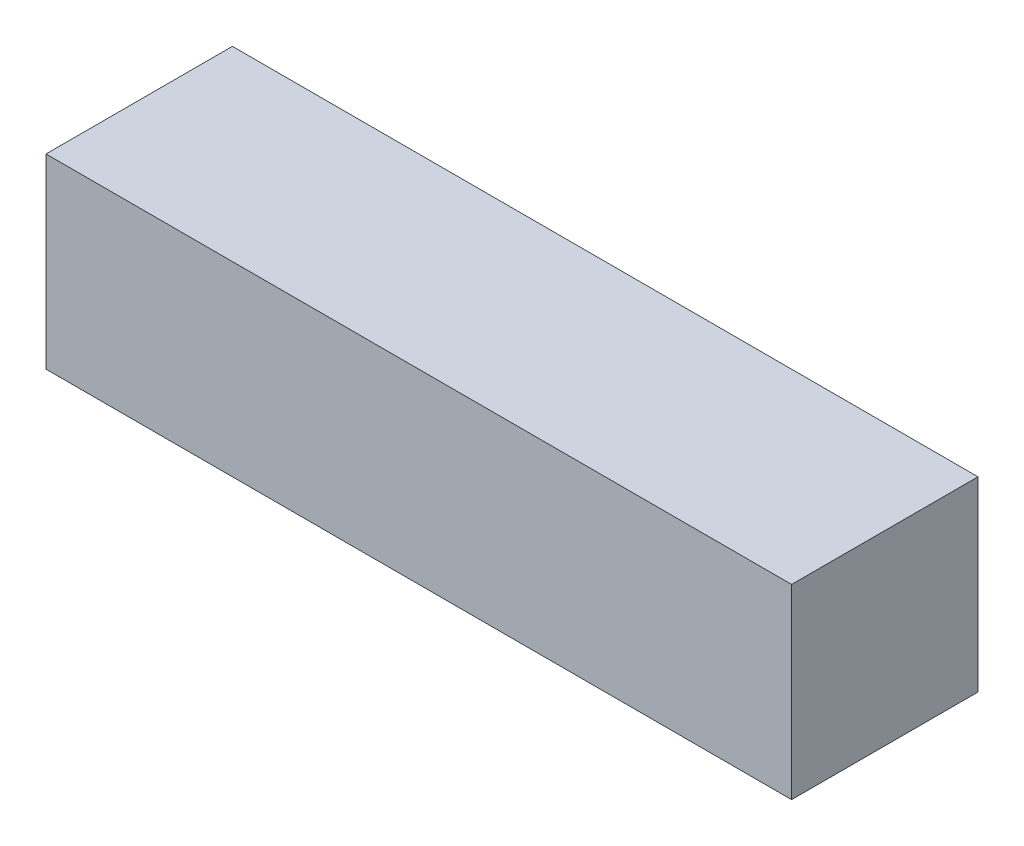
ISO-10303-21;
HEADER;
FILE_DESCRIPTION(('STEP AP214'),'2;1');
FILE_NAME('part.step','',(''),(''),'','','');
FILE_SCHEMA(('AUTOMOTIVE_DESIGN { 1 0 10303 214 1 1 1 1 }'));
ENDSEC;
DATA;
#1=APPLICATION_CONTEXT('core data for automotive mechanical design processes');
#2=APPLICATION_PROTOCOL_DEFINITION('international standard','automotive_design',2000,#1);
#3=PRODUCT_CONTEXT('',#1,'mechanical');
#4=PRODUCT('Part','Part','',(#3));
#5=PRODUCT_RELATED_PRODUCT_CATEGORY('part','',(#4));
#6=PRODUCT_DEFINITION_FORMATION('','',#4);
#7=PRODUCT_DEFINITION_CONTEXT('part definition',#1,'design');
#8=PRODUCT_DEFINITION('design','',#6,#7);
#9=PRODUCT_DEFINITION_SHAPE('','',#8);
#10=(LENGTH_UNIT() NAMED_UNIT(*) SI_UNIT(.MILLI.,.METRE.));
#11=(NAMED_UNIT(*) PLANE_ANGLE_UNIT() SI_UNIT($,.RADIAN.));
#12=(NAMED_UNIT(*) SI_UNIT($,.STERADIAN.) SOLID_ANGLE_UNIT());
#13=UNCERTAINTY_MEASURE_WITH_UNIT(LENGTH_MEASURE(1.E-05),#10,'distance_accuracy_value','');
#14=(GEOMETRIC_REPRESENTATION_CONTEXT(3) GLOBAL_UNCERTAINTY_ASSIGNED_CONTEXT((#13)) GLOBAL_UNIT_ASSIGNED_CONTEXT((#10,
#11,#12)) REPRESENTATION_CONTEXT('',''));
#15=CARTESIAN_POINT('',(0.,0.,0.));
#16=DIRECTION('',(0.,0.,1.));
#17=DIRECTION('',(1.,0.,0.));
#18=AXIS2_PLACEMENT_3D('',#15,#16,#17);
#19=CARTESIAN_POINT('',(-6.35,-1.5875,-1.5875));
#20=DIRECTION('',(-1.,0.,0.));
#21=DIRECTION('',(0.,0.,1.));
#22=AXIS2_PLACEMENT_3D('',#19,#20,#21);
#23=PLANE('',#22);
#24=DIRECTION('',(0.,1.,0.));
#25=VECTOR('',#24,1.);
#26=CARTESIAN_POINT('',(-6.35,-1.5875,1.5875));
#27=LINE('',#26,#25);
#28=CARTESIAN_POINT('',(-6.35,-1.5875,1.5875));
#29=VERTEX_POINT('',#28);
#30=CARTESIAN_POINT('',(-6.35,1.5875,1.5875));
#31=VERTEX_POINT('',#30);
#32=EDGE_CURVE('E37',#29,#31,#27,.T.);
#33=ORIENTED_EDGE('',*,*,#32,.T.);
#34=DIRECTION('',(0.,0.,1.));
#35=VECTOR('',#34,1.);
#36=CARTESIAN_POINT('',(-6.35,1.5875,-1.5875));
#37=LINE('',#36,#35);
#38=CARTESIAN_POINT('',(-6.35,1.5875,-1.5875));
#39=VERTEX_POINT('',#38);
#40=EDGE_CURVE('E74',#39,#31,#37,.T.);
#41=ORIENTED_EDGE('',*,*,#40,.F.);
#42=DIRECTION('',(0.,1.,0.));
#43=VECTOR('',#42,1.);
#44=CARTESIAN_POINT('',(-6.35,-1.5875,-1.5875));
#45=LINE('',#44,#43);
#46=CARTESIAN_POINT('',(-6.35,-1.5875,-1.5875));
#47=VERTEX_POINT('',#46);
#48=EDGE_CURVE('E11',#47,#39,#45,.T.);
#49=ORIENTED_EDGE('',*,*,#48,.F.);
#50=DIRECTION('',(0.,0.,1.));
#51=VECTOR('',#50,1.);
#52=CARTESIAN_POINT('',(-6.35,-1.5875,-1.5875));
#53=LINE('',#52,#51);
#54=EDGE_CURVE('E75',#47,#29,#53,.T.);
#55=ORIENTED_EDGE('',*,*,#54,.T.);
#56=EDGE_LOOP('',(#33,#41,#49,#55));
#57=FACE_BOUND('',#56,.T.);
#58=ADVANCED_FACE('F34',(#57),#23,.T.);
#59=CARTESIAN_POINT('',(-6.35,-1.5875,-1.5875));
#60=DIRECTION('',(0.,0.,-1.));
#61=DIRECTION('',(-1.,0.,0.));
#62=AXIS2_PLACEMENT_3D('',#59,#60,#61);
#63=PLANE('',#62);
#64=ORIENTED_EDGE('',*,*,#48,.T.);
#65=DIRECTION('',(-1.,0.,0.));
#66=VECTOR('',#65,1.);
#67=CARTESIAN_POINT('',(-6.35,1.5875,-1.5875));
#68=LINE('',#67,#66);
#69=CARTESIAN_POINT('',(6.35,1.5875,-1.5875));
#70=VERTEX_POINT('',#69);
#71=EDGE_CURVE('E91',#70,#39,#68,.T.);
#72=ORIENTED_EDGE('',*,*,#71,.F.);
#73=DIRECTION('',(0.,1.,0.));
#74=VECTOR('',#73,1.);
#75=CARTESIAN_POINT('',(6.35,-1.5875,-1.5875));
#76=LINE('',#75,#74);
#77=CARTESIAN_POINT('',(6.35,-1.5875,-1.5875));
#78=VERTEX_POINT('',#77);
#79=EDGE_CURVE('E42',#78,#70,#76,.T.);
#80=ORIENTED_EDGE('',*,*,#79,.F.);
#81=DIRECTION('',(-1.,0.,0.));
#82=VECTOR('',#81,1.);
#83=CARTESIAN_POINT('',(-6.35,-1.5875,-1.5875));
#84=LINE('',#83,#82);
#85=EDGE_CURVE('E80',#78,#47,#84,.T.);
#86=ORIENTED_EDGE('',*,*,#85,.T.);
#87=EDGE_LOOP('',(#64,#72,#80,#86));
#88=FACE_BOUND('',#87,.T.);
#89=ADVANCED_FACE('F106',(#88),#63,.T.);
#90=CARTESIAN_POINT('',(6.35,-1.5875,-1.5875));
#91=DIRECTION('',(1.,0.,0.));
#92=DIRECTION('',(0.,0.,-1.));
#93=AXIS2_PLACEMENT_3D('',#90,#91,#92);
#94=PLANE('',#93);
#95=ORIENTED_EDGE('',*,*,#79,.T.);
#96=DIRECTION('',(0.,0.,-1.));
#97=VECTOR('',#96,1.);
#98=CARTESIAN_POINT('',(6.35,1.5875,-1.5875));
#99=LINE('',#98,#97);
#100=CARTESIAN_POINT('',(6.35,1.5875,1.5875));
#101=VERTEX_POINT('',#100);
#102=EDGE_CURVE('E87',#101,#70,#99,.T.);
#103=ORIENTED_EDGE('',*,*,#102,.F.);
#104=DIRECTION('',(0.,1.,0.));
#105=VECTOR('',#104,1.);
#106=CARTESIAN_POINT('',(6.35,-1.5875,1.5875));
#107=LINE('',#106,#105);
#108=CARTESIAN_POINT('',(6.35,-1.5875,1.5875));
#109=VERTEX_POINT('',#108);
#110=EDGE_CURVE('E79',#109,#101,#107,.T.);
#111=ORIENTED_EDGE('',*,*,#110,.F.);
#112=DIRECTION('',(0.,0.,-1.));
#113=VECTOR('',#112,1.);
#114=CARTESIAN_POINT('',(6.35,-1.5875,-1.5875));
#115=LINE('',#114,#113);
#116=EDGE_CURVE('E99',#109,#78,#115,.T.);
#117=ORIENTED_EDGE('',*,*,#116,.T.);
#118=EDGE_LOOP('',(#95,#103,#111,#117));
#119=FACE_BOUND('',#118,.T.);
#120=ADVANCED_FACE('F103',(#119),#94,.T.);
#121=CARTESIAN_POINT('',(-6.35,-1.5875,1.5875));
#122=DIRECTION('',(0.,0.,1.));
#123=DIRECTION('',(1.,0.,0.));
#124=AXIS2_PLACEMENT_3D('',#121,#122,#123);
#125=PLANE('',#124);
#126=ORIENTED_EDGE('',*,*,#110,.T.);
#127=DIRECTION('',(1.,0.,0.));
#128=VECTOR('',#127,1.);
#129=CARTESIAN_POINT('',(-6.35,1.5875,1.5875));
#130=LINE('',#129,#128);
#131=EDGE_CURVE('E82',#31,#101,#130,.T.);
#132=ORIENTED_EDGE('',*,*,#131,.F.);
#133=ORIENTED_EDGE('',*,*,#32,.F.);
#134=DIRECTION('',(1.,0.,0.));
#135=VECTOR('',#134,1.);
#136=CARTESIAN_POINT('',(-6.35,-1.5875,1.5875));
#137=LINE('',#136,#135);
#138=EDGE_CURVE('E97',#29,#109,#137,.T.);
#139=ORIENTED_EDGE('',*,*,#138,.T.);
#140=EDGE_LOOP('',(#126,#132,#133,#139));
#141=FACE_BOUND('',#140,.T.);
#142=ADVANCED_FACE('F83',(#141),#125,.T.);
#143=CARTESIAN_POINT('',(-6.35,-1.5875,1.5875));
#144=DIRECTION('',(0.,1.,0.));
#145=DIRECTION('',(0.,0.,1.));
#146=AXIS2_PLACEMENT_3D('',#143,#144,#145);
#147=PLANE('',#146);
#148=ORIENTED_EDGE('',*,*,#54,.F.);
#149=ORIENTED_EDGE('',*,*,#85,.F.);
#150=ORIENTED_EDGE('',*,*,#116,.F.);
#151=ORIENTED_EDGE('',*,*,#138,.F.);
#152=EDGE_LOOP('',(#148,#149,#150,#151));
#153=FACE_BOUND('',#152,.T.);
#154=ADVANCED_FACE('F108',(#153),#147,.F.);
#155=CARTESIAN_POINT('',(-6.35,1.5875,1.5875));
#156=DIRECTION('',(0.,1.,0.));
#157=DIRECTION('',(0.,0.,1.));
#158=AXIS2_PLACEMENT_3D('',#155,#156,#157);
#159=PLANE('',#158);
#160=ORIENTED_EDGE('',*,*,#40,.T.);
#161=ORIENTED_EDGE('',*,*,#131,.T.);
#162=ORIENTED_EDGE('',*,*,#102,.T.);
#163=ORIENTED_EDGE('',*,*,#71,.T.);
#164=EDGE_LOOP('',(#160,#161,#162,#163));
#165=FACE_BOUND('',#164,.T.);
#166=ADVANCED_FACE('F90',(#165),#159,.T.);
#167=CLOSED_SHELL('',(#58,#89,#120,#142,#154,#166));
#168=MANIFOLD_SOLID_BREP('B2',#167);
#169=ADVANCED_BREP_SHAPE_REPRESENTATION('',(#18,#168),#14);
#170=SHAPE_DEFINITION_REPRESENTATION(#9,#169);
ENDSEC;
END-ISO-10303-21;
